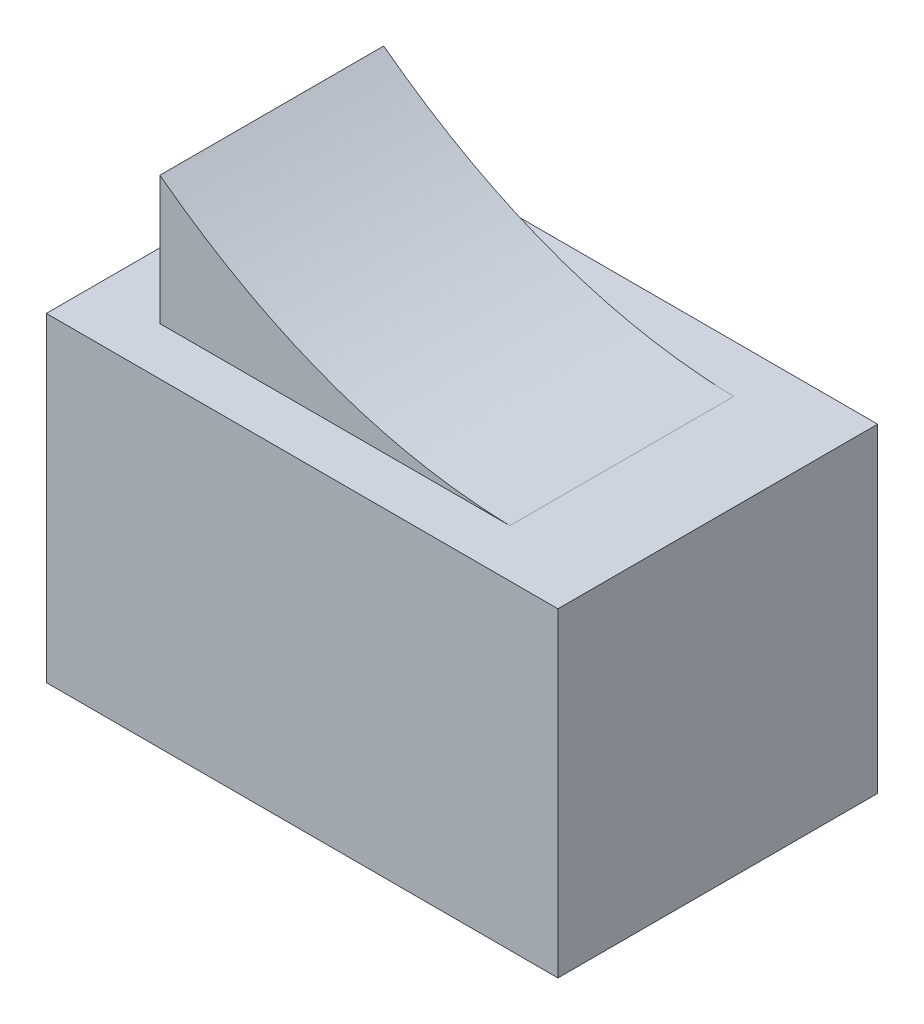
ISO-10303-21;
HEADER;
FILE_DESCRIPTION(('STEP AP214'),'2;1');
FILE_NAME('part.step','',(''),(''),'','','');
FILE_SCHEMA(('AUTOMOTIVE_DESIGN { 1 0 10303 214 1 1 1 1 }'));
ENDSEC;
DATA;
#1=APPLICATION_CONTEXT('core data for automotive mechanical design processes');
#2=APPLICATION_PROTOCOL_DEFINITION('international standard','automotive_design',2000,#1);
#3=PRODUCT_CONTEXT('',#1,'mechanical');
#4=PRODUCT('Part','Part','',(#3));
#5=PRODUCT_RELATED_PRODUCT_CATEGORY('part','',(#4));
#6=PRODUCT_DEFINITION_FORMATION('','',#4);
#7=PRODUCT_DEFINITION_CONTEXT('part definition',#1,'design');
#8=PRODUCT_DEFINITION('design','',#6,#7);
#9=PRODUCT_DEFINITION_SHAPE('','',#8);
#10=(LENGTH_UNIT() NAMED_UNIT(*) SI_UNIT(.MILLI.,.METRE.));
#11=(NAMED_UNIT(*) PLANE_ANGLE_UNIT() SI_UNIT($,.RADIAN.));
#12=(NAMED_UNIT(*) SI_UNIT($,.STERADIAN.) SOLID_ANGLE_UNIT());
#13=UNCERTAINTY_MEASURE_WITH_UNIT(LENGTH_MEASURE(1.E-05),#10,'distance_accuracy_value','');
#14=(GEOMETRIC_REPRESENTATION_CONTEXT(3) GLOBAL_UNCERTAINTY_ASSIGNED_CONTEXT((#13)) GLOBAL_UNIT_ASSIGNED_CONTEXT((#10,
#11,#12)) REPRESENTATION_CONTEXT('',''));
#15=CARTESIAN_POINT('',(0.,0.,0.));
#16=DIRECTION('',(0.,0.,1.));
#17=DIRECTION('',(1.,0.,0.));
#18=AXIS2_PLACEMENT_3D('',#15,#16,#17);
#19=CARTESIAN_POINT('',(10.16,12.7,6.35));
#20=DIRECTION('',(-1.,0.,0.));
#21=DIRECTION('',(0.,0.,1.));
#22=AXIS2_PLACEMENT_3D('',#19,#20,#21);
#23=PLANE('',#22);
#24=DIRECTION('',(0.,0.,-1.));
#25=VECTOR('',#24,1.);
#26=CARTESIAN_POINT('',(10.16,0.,6.35));
#27=LINE('',#26,#25);
#28=CARTESIAN_POINT('',(10.16,0.,6.35));
#29=VERTEX_POINT('',#28);
#30=CARTESIAN_POINT('',(10.16,0.,-6.35));
#31=VERTEX_POINT('',#30);
#32=EDGE_CURVE('E120',#29,#31,#27,.T.);
#33=ORIENTED_EDGE('',*,*,#32,.T.);
#34=DIRECTION('',(0.,-1.,0.));
#35=VECTOR('',#34,1.);
#36=CARTESIAN_POINT('',(10.16,12.7,-6.35));
#37=LINE('',#36,#35);
#38=CARTESIAN_POINT('',(10.16,12.7,-6.35));
#39=VERTEX_POINT('',#38);
#40=EDGE_CURVE('E11',#39,#31,#37,.T.);
#41=ORIENTED_EDGE('',*,*,#40,.F.);
#42=DIRECTION('',(0.,0.,-1.));
#43=VECTOR('',#42,1.);
#44=CARTESIAN_POINT('',(10.16,12.7,6.35));
#45=LINE('',#44,#43);
#46=CARTESIAN_POINT('',(10.16,12.7,6.35));
#47=VERTEX_POINT('',#46);
#48=EDGE_CURVE('E159',#47,#39,#45,.T.);
#49=ORIENTED_EDGE('',*,*,#48,.F.);
#50=DIRECTION('',(0.,-1.,0.));
#51=VECTOR('',#50,1.);
#52=CARTESIAN_POINT('',(10.16,12.7,6.35));
#53=LINE('',#52,#51);
#54=EDGE_CURVE('E169',#47,#29,#53,.T.);
#55=ORIENTED_EDGE('',*,*,#54,.T.);
#56=EDGE_LOOP('',(#33,#41,#49,#55));
#57=FACE_BOUND('',#56,.T.);
#58=ADVANCED_FACE('F43',(#57),#23,.F.);
#59=CARTESIAN_POINT('',(-10.16,12.7,-6.35));
#60=DIRECTION('',(0.,0.,1.));
#61=DIRECTION('',(1.,0.,0.));
#62=AXIS2_PLACEMENT_3D('',#59,#60,#61);
#63=PLANE('',#62);
#64=DIRECTION('',(-1.,0.,0.));
#65=VECTOR('',#64,1.);
#66=CARTESIAN_POINT('',(-10.16,0.,-6.35));
#67=LINE('',#66,#65);
#68=CARTESIAN_POINT('',(-10.16,0.,-6.35));
#69=VERTEX_POINT('',#68);
#70=EDGE_CURVE('E173',#31,#69,#67,.T.);
#71=ORIENTED_EDGE('',*,*,#70,.T.);
#72=DIRECTION('',(0.,-1.,0.));
#73=VECTOR('',#72,1.);
#74=CARTESIAN_POINT('',(-10.16,12.7,-6.35));
#75=LINE('',#74,#73);
#76=CARTESIAN_POINT('',(-10.16,12.7,-6.35));
#77=VERTEX_POINT('',#76);
#78=EDGE_CURVE('E51',#77,#69,#75,.T.);
#79=ORIENTED_EDGE('',*,*,#78,.F.);
#80=DIRECTION('',(-1.,0.,0.));
#81=VECTOR('',#80,1.);
#82=CARTESIAN_POINT('',(-10.16,12.7,-6.35));
#83=LINE('',#82,#81);
#84=EDGE_CURVE('E95',#39,#77,#83,.T.);
#85=ORIENTED_EDGE('',*,*,#84,.F.);
#86=ORIENTED_EDGE('',*,*,#40,.T.);
#87=EDGE_LOOP('',(#71,#79,#85,#86));
#88=FACE_BOUND('',#87,.T.);
#89=ADVANCED_FACE('F208',(#88),#63,.F.);
#90=CARTESIAN_POINT('',(-10.16,12.7,6.35));
#91=DIRECTION('',(1.,0.,0.));
#92=DIRECTION('',(0.,0.,-1.));
#93=AXIS2_PLACEMENT_3D('',#90,#91,#92);
#94=PLANE('',#93);
#95=DIRECTION('',(0.,0.,1.));
#96=VECTOR('',#95,1.);
#97=CARTESIAN_POINT('',(-10.16,0.,6.35));
#98=LINE('',#97,#96);
#99=CARTESIAN_POINT('',(-10.16,0.,6.35));
#100=VERTEX_POINT('',#99);
#101=EDGE_CURVE('E176',#69,#100,#98,.T.);
#102=ORIENTED_EDGE('',*,*,#101,.T.);
#103=DIRECTION('',(0.,-1.,0.));
#104=VECTOR('',#103,1.);
#105=CARTESIAN_POINT('',(-10.16,12.7,6.35));
#106=LINE('',#105,#104);
#107=CARTESIAN_POINT('',(-10.16,12.7,6.35));
#108=VERTEX_POINT('',#107);
#109=EDGE_CURVE('E183',#108,#100,#106,.T.);
#110=ORIENTED_EDGE('',*,*,#109,.F.);
#111=DIRECTION('',(0.,0.,1.));
#112=VECTOR('',#111,1.);
#113=CARTESIAN_POINT('',(-10.16,12.7,6.35));
#114=LINE('',#113,#112);
#115=EDGE_CURVE('E164',#77,#108,#114,.T.);
#116=ORIENTED_EDGE('',*,*,#115,.F.);
#117=ORIENTED_EDGE('',*,*,#78,.T.);
#118=EDGE_LOOP('',(#102,#110,#116,#117));
#119=FACE_BOUND('',#118,.T.);
#120=ADVANCED_FACE('F190',(#119),#94,.F.);
#121=CARTESIAN_POINT('',(-10.16,12.7,6.35));
#122=DIRECTION('',(0.,0.,-1.));
#123=DIRECTION('',(-1.,0.,0.));
#124=AXIS2_PLACEMENT_3D('',#121,#122,#123);
#125=PLANE('',#124);
#126=DIRECTION('',(1.,0.,0.));
#127=VECTOR('',#126,1.);
#128=CARTESIAN_POINT('',(-10.16,0.,6.35));
#129=LINE('',#128,#127);
#130=EDGE_CURVE('E88',#100,#29,#129,.T.);
#131=ORIENTED_EDGE('',*,*,#130,.T.);
#132=ORIENTED_EDGE('',*,*,#54,.F.);
#133=DIRECTION('',(1.,0.,0.));
#134=VECTOR('',#133,1.);
#135=CARTESIAN_POINT('',(-10.16,12.7,6.35));
#136=LINE('',#135,#134);
#137=EDGE_CURVE('E67',#108,#47,#136,.T.);
#138=ORIENTED_EDGE('',*,*,#137,.F.);
#139=ORIENTED_EDGE('',*,*,#109,.T.);
#140=EDGE_LOOP('',(#131,#132,#138,#139));
#141=FACE_BOUND('',#140,.T.);
#142=ADVANCED_FACE('F198',(#141),#125,.F.);
#143=CARTESIAN_POINT('',(0.,12.7,0.));
#144=DIRECTION('',(0.,-1.,0.));
#145=DIRECTION('',(0.,0.,-1.));
#146=AXIS2_PLACEMENT_3D('',#143,#144,#145);
#147=PLANE('',#146);
#148=DIRECTION('',(0.,0.,-1.));
#149=VECTOR('',#148,1.);
#150=CARTESIAN_POINT('',(-7.55561253909406,12.7,4.445));
#151=LINE('',#150,#149);
#152=CARTESIAN_POINT('',(-7.55561253909406,12.7,4.445));
#153=VERTEX_POINT('',#152);
#154=CARTESIAN_POINT('',(-7.55561253909406,12.7,-4.445));
#155=VERTEX_POINT('',#154);
#156=EDGE_CURVE('E121',#153,#155,#151,.T.);
#157=ORIENTED_EDGE('',*,*,#156,.T.);
#158=DIRECTION('',(1.,0.,0.));
#159=VECTOR('',#158,1.);
#160=CARTESIAN_POINT('',(0.,12.7,-4.445));
#161=LINE('',#160,#159);
#162=CARTESIAN_POINT('',(6.3477185940863,12.7,-4.445));
#163=VERTEX_POINT('',#162);
#164=EDGE_CURVE('E130',#155,#163,#161,.T.);
#165=ORIENTED_EDGE('',*,*,#164,.T.);
#166=DIRECTION('',(0.,0.,-1.));
#167=VECTOR('',#166,1.);
#168=CARTESIAN_POINT('',(6.3477185940863,12.7,4.445));
#169=LINE('',#168,#167);
#170=CARTESIAN_POINT('',(6.3477185940863,12.7,4.445));
#171=VERTEX_POINT('',#170);
#172=EDGE_CURVE('E137',#171,#163,#169,.T.);
#173=ORIENTED_EDGE('',*,*,#172,.F.);
#174=DIRECTION('',(1.,0.,0.));
#175=VECTOR('',#174,1.);
#176=CARTESIAN_POINT('',(0.,12.7,4.445));
#177=LINE('',#176,#175);
#178=EDGE_CURVE('E128',#153,#171,#177,.T.);
#179=ORIENTED_EDGE('',*,*,#178,.F.);
#180=EDGE_LOOP('',(#157,#165,#173,#179));
#181=FACE_BOUND('',#180,.T.);
#182=ORIENTED_EDGE('',*,*,#48,.T.);
#183=ORIENTED_EDGE('',*,*,#84,.T.);
#184=ORIENTED_EDGE('',*,*,#115,.T.);
#185=ORIENTED_EDGE('',*,*,#137,.T.);
#186=EDGE_LOOP('',(#182,#183,#184,#185));
#187=FACE_BOUND('',#186,.T.);
#188=ADVANCED_FACE('F200',(#181,#187),#147,.F.);
#189=CARTESIAN_POINT('',(0.,0.,0.));
#190=DIRECTION('',(0.,-1.,0.));
#191=DIRECTION('',(0.,0.,-1.));
#192=AXIS2_PLACEMENT_3D('',#189,#190,#191);
#193=PLANE('',#192);
#194=ORIENTED_EDGE('',*,*,#32,.F.);
#195=ORIENTED_EDGE('',*,*,#130,.F.);
#196=ORIENTED_EDGE('',*,*,#101,.F.);
#197=ORIENTED_EDGE('',*,*,#70,.F.);
#198=EDGE_LOOP('',(#194,#195,#196,#197));
#199=FACE_BOUND('',#198,.T.);
#200=ADVANCED_FACE('F194',(#199),#193,.T.);
#201=CARTESIAN_POINT('',(-7.55561253909406,17.803216517864,4.445));
#202=CARTESIAN_POINT('',(-0.504392769615974,12.4970044312422,4.445));
#203=CARTESIAN_POINT('',(7.52596699520346,12.7,4.445));
#204=B_SPLINE_CURVE_WITH_KNOTS('',2,(#201,#202,#203),.UNSPECIFIED.,.F.,.F.,(3,3),(0.,1.),.UNSPECIFIED.);
#205=DIRECTION('',(0.,0.,-1.));
#206=VECTOR('',#205,1.);
#207=SURFACE_OF_LINEAR_EXTRUSION('',#204,#206);
#208=CARTESIAN_POINT('',(-7.55561253909406,17.803216517864,-4.445));
#209=CARTESIAN_POINT('',(-0.504392769615974,12.4970044312422,-4.445));
#210=CARTESIAN_POINT('',(7.52596699520346,12.7,-4.445));
#211=B_SPLINE_CURVE_WITH_KNOTS('',2,(#208,#209,#210),.UNSPECIFIED.,.F.,.F.,(3,3),(0.,1.),.UNSPECIFIED.);
#212=CARTESIAN_POINT('',(-7.55561253909406,17.803216517864,-4.445));
#213=VERTEX_POINT('',#212);
#214=EDGE_CURVE('E117',#213,#163,#211,.T.);
#215=ORIENTED_EDGE('',*,*,#214,.F.);
#216=DIRECTION('',(0.,0.,-1.));
#217=VECTOR('',#216,1.);
#218=CARTESIAN_POINT('',(-7.55561253909406,17.803216517864,4.445));
#219=LINE('',#218,#217);
#220=CARTESIAN_POINT('',(-7.55561253909406,17.803216517864,4.445));
#221=VERTEX_POINT('',#220);
#222=EDGE_CURVE('E111',#221,#213,#219,.T.);
#223=ORIENTED_EDGE('',*,*,#222,.F.);
#224=EDGE_CURVE('E114',#221,#171,#204,.T.);
#225=ORIENTED_EDGE('',*,*,#224,.T.);
#226=ORIENTED_EDGE('',*,*,#172,.T.);
#227=EDGE_LOOP('',(#215,#223,#225,#226));
#228=FACE_BOUND('',#227,.T.);
#229=ADVANCED_FACE('F113',(#228),#207,.T.);
#230=CARTESIAN_POINT('',(-7.55561253909406,0.,4.445));
#231=DIRECTION('',(-1.,0.,0.));
#232=DIRECTION('',(0.,0.,1.));
#233=AXIS2_PLACEMENT_3D('',#230,#231,#232);
#234=PLANE('',#233);
#235=DIRECTION('',(0.,1.,0.));
#236=VECTOR('',#235,1.);
#237=CARTESIAN_POINT('',(-7.55561253909406,0.,-4.445));
#238=LINE('',#237,#236);
#239=EDGE_CURVE('E58',#155,#213,#238,.T.);
#240=ORIENTED_EDGE('',*,*,#239,.F.);
#241=ORIENTED_EDGE('',*,*,#156,.F.);
#242=DIRECTION('',(0.,1.,0.));
#243=VECTOR('',#242,1.);
#244=CARTESIAN_POINT('',(-7.55561253909406,0.,4.445));
#245=LINE('',#244,#243);
#246=EDGE_CURVE('E126',#153,#221,#245,.T.);
#247=ORIENTED_EDGE('',*,*,#246,.T.);
#248=ORIENTED_EDGE('',*,*,#222,.T.);
#249=EDGE_LOOP('',(#240,#241,#247,#248));
#250=FACE_BOUND('',#249,.T.);
#251=ADVANCED_FACE('F132',(#250),#234,.T.);
#252=CARTESIAN_POINT('',(0.,0.,4.445));
#253=DIRECTION('',(0.,0.,1.));
#254=DIRECTION('',(1.,0.,0.));
#255=AXIS2_PLACEMENT_3D('',#252,#253,#254);
#256=PLANE('',#255);
#257=ORIENTED_EDGE('',*,*,#224,.F.);
#258=ORIENTED_EDGE('',*,*,#246,.F.);
#259=ORIENTED_EDGE('',*,*,#178,.T.);
#260=EDGE_LOOP('',(#257,#258,#259));
#261=FACE_BOUND('',#260,.T.);
#262=ADVANCED_FACE('F125',(#261),#256,.T.);
#263=CARTESIAN_POINT('',(0.,0.,-4.445));
#264=DIRECTION('',(0.,0.,1.));
#265=DIRECTION('',(1.,0.,0.));
#266=AXIS2_PLACEMENT_3D('',#263,#264,#265);
#267=PLANE('',#266);
#268=ORIENTED_EDGE('',*,*,#214,.T.);
#269=ORIENTED_EDGE('',*,*,#164,.F.);
#270=ORIENTED_EDGE('',*,*,#239,.T.);
#271=EDGE_LOOP('',(#268,#269,#270));
#272=FACE_BOUND('',#271,.T.);
#273=ADVANCED_FACE('F269',(#272),#267,.F.);
#274=CLOSED_SHELL('',(#58,#89,#120,#142,#188,#200,#229,#251,#262,#273));
#275=MANIFOLD_SOLID_BREP('B2',#274);
#276=ADVANCED_BREP_SHAPE_REPRESENTATION('',(#18,#275),#14);
#277=SHAPE_DEFINITION_REPRESENTATION(#9,#276);
ENDSEC;
END-ISO-10303-21;
